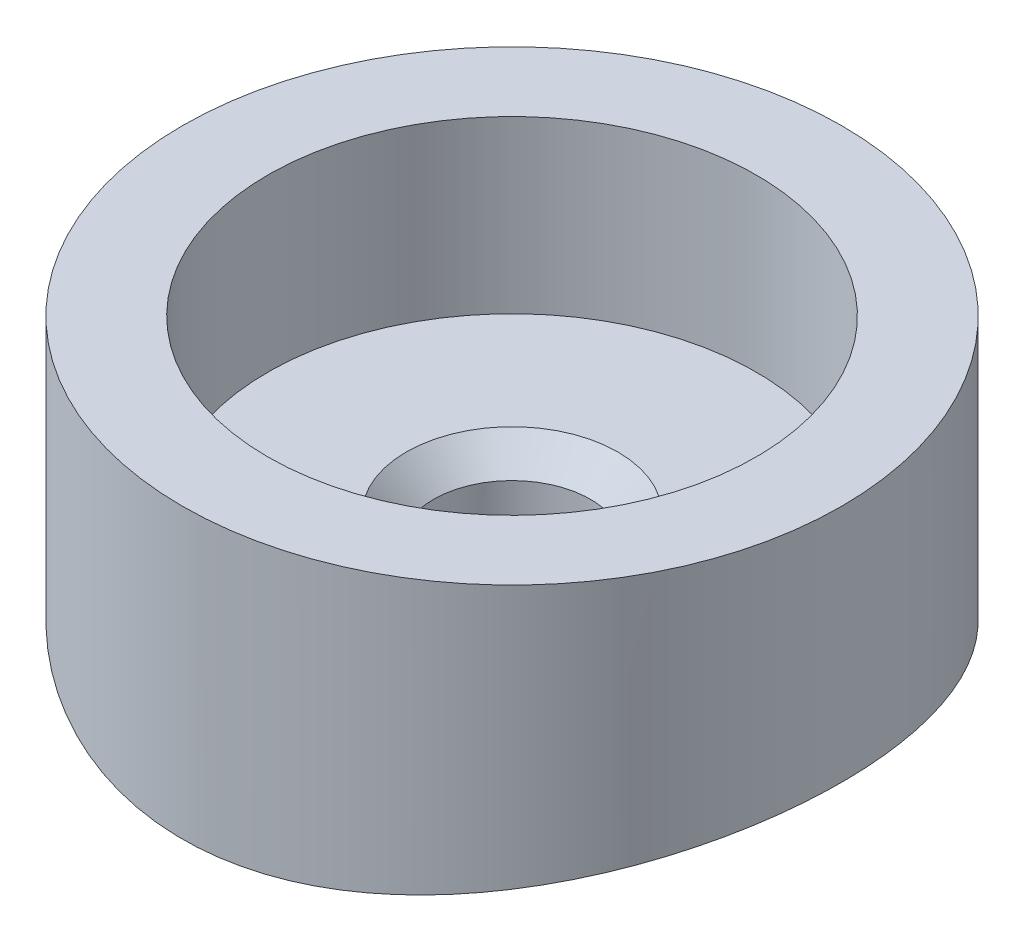
ISO-10303-21;
HEADER;
FILE_DESCRIPTION(('STEP AP214'),'2;1');
FILE_NAME('part.step','',(''),(''),'','','');
FILE_SCHEMA(('AUTOMOTIVE_DESIGN { 1 0 10303 214 1 1 1 1 }'));
ENDSEC;
DATA;
#1=APPLICATION_CONTEXT('core data for automotive mechanical design processes');
#2=APPLICATION_PROTOCOL_DEFINITION('international standard','automotive_design',2000,#1);
#3=PRODUCT_CONTEXT('',#1,'mechanical');
#4=PRODUCT('Part','Part','',(#3));
#5=PRODUCT_RELATED_PRODUCT_CATEGORY('part','',(#4));
#6=PRODUCT_DEFINITION_FORMATION('','',#4);
#7=PRODUCT_DEFINITION_CONTEXT('part definition',#1,'design');
#8=PRODUCT_DEFINITION('design','',#6,#7);
#9=PRODUCT_DEFINITION_SHAPE('','',#8);
#10=(LENGTH_UNIT() NAMED_UNIT(*) SI_UNIT(.MILLI.,.METRE.));
#11=(NAMED_UNIT(*) PLANE_ANGLE_UNIT() SI_UNIT($,.RADIAN.));
#12=(NAMED_UNIT(*) SI_UNIT($,.STERADIAN.) SOLID_ANGLE_UNIT());
#13=UNCERTAINTY_MEASURE_WITH_UNIT(LENGTH_MEASURE(1.E-05),#10,'distance_accuracy_value','');
#14=(GEOMETRIC_REPRESENTATION_CONTEXT(3) GLOBAL_UNCERTAINTY_ASSIGNED_CONTEXT((#13)) GLOBAL_UNIT_ASSIGNED_CONTEXT((#10,
#11,#12)) REPRESENTATION_CONTEXT('',''));
#15=CARTESIAN_POINT('',(0.,0.,0.));
#16=DIRECTION('',(0.,0.,1.));
#17=DIRECTION('',(1.,0.,0.));
#18=AXIS2_PLACEMENT_3D('',#15,#16,#17);
#19=CARTESIAN_POINT('',(0.,25.4,0.));
#20=DIRECTION('',(0.,-1.,0.));
#21=DIRECTION('',(0.,0.,-1.));
#22=AXIS2_PLACEMENT_3D('',#19,#20,#21);
#23=CYLINDRICAL_SURFACE('',#22,24.511);
#24=CARTESIAN_POINT('',(0.,25.4,0.));
#25=DIRECTION('',(0.,1.,0.));
#26=DIRECTION('',(0.,0.,1.));
#27=AXIS2_PLACEMENT_3D('',#24,#25,#26);
#28=CIRCLE('',#27,24.511);
#29=CARTESIAN_POINT('',(0.,25.4,24.511));
#30=VERTEX_POINT('',#29);
#31=EDGE_CURVE('E59',#30,#30,#28,.T.);
#32=ORIENTED_EDGE('',*,*,#31,.F.);
#33=EDGE_LOOP('',(#32));
#34=FACE_BOUND('',#33,.T.);
#35=CARTESIAN_POINT('',(0.,3.95611816324441,-24.511));
#36=CARTESIAN_POINT('',(0.672439461266802,3.95611933237046,-24.5109983821655));
#37=CARTESIAN_POINT('',(1.34490774312686,3.96460296071418,-24.4833048628042));
#38=CARTESIAN_POINT('',(2.68489418489964,3.99827435073769,-24.3727815587225));
#39=CARTESIAN_POINT('',(3.35241205692603,4.02346307630222,-24.2899485924528));
#40=CARTESIAN_POINT('',(4.67782904886675,4.0897696746324,-24.0698664591824));
#41=CARTESIAN_POINT('',(5.33572497877211,4.13089271127498,-23.9325996513156));
#42=CARTESIAN_POINT('',(6.63700138726666,4.22780625289299,-23.6048624955393));
#43=CARTESIAN_POINT('',(7.28038200028337,4.28359662197247,-23.4143926405665));
#44=CARTESIAN_POINT('',(8.54720598320212,4.40807186695242,-22.982201456061));
#45=CARTESIAN_POINT('',(9.17068020390343,4.47673553076574,-22.74056435422));
#46=CARTESIAN_POINT('',(10.3947216002538,4.62502317101238,-22.2077563735001));
#47=CARTESIAN_POINT('',(10.9952887445319,4.70464716245507,-21.9165854267881));
#48=CARTESIAN_POINT('',(12.1698047594676,4.87261875270195,-21.2868279448396));
#49=CARTESIAN_POINT('',(12.7437512406286,4.96096713239716,-20.9482371640749));
#50=CARTESIAN_POINT('',(13.8614939392133,5.14396259922234,-20.2259952261178));
#51=CARTESIAN_POINT('',(14.4052895291262,5.2386098173558,-19.8423431316115));
#52=CARTESIAN_POINT('',(15.4738539437055,5.43430678473352,-19.0214394472943));
#53=CARTESIAN_POINT('',(15.9977011891257,5.53546070349572,-18.5830126288436));
#54=CARTESIAN_POINT('',(17.0068779063594,5.73895805909062,-17.6641147432734));
#55=CARTESIAN_POINT('',(17.4922067419381,5.84130151553971,-17.1836429819446));
#56=CARTESIAN_POINT('',(18.4213068193913,6.04440563043572,-16.1836468043778));
#57=CARTESIAN_POINT('',(18.8650731619719,6.14516610112164,-15.664117797138));
#58=CARTESIAN_POINT('',(19.7080560703237,6.34236955506934,-14.589314821801));
#59=CARTESIAN_POINT('',(20.1072723400014,6.43881250963305,-14.0340406161688));
#60=CARTESIAN_POINT('',(20.865759050045,6.62659887375901,-12.880033049961));
#61=CARTESIAN_POINT('',(21.224092673961,6.71780520040733,-12.2806610030964));
#62=CARTESIAN_POINT('',(21.8888325615432,6.89043989110083,-11.0524091257498));
#63=CARTESIAN_POINT('',(22.1952379439457,6.97186808919654,-10.4235287947199));
#64=CARTESIAN_POINT('',(22.7535772935892,7.12260361408897,-9.14073691561948));
#65=CARTESIAN_POINT('',(23.0055198642564,7.19191285497195,-8.48682934031107));
#66=CARTESIAN_POINT('',(23.4528067176099,7.31641295531283,-7.15862927282911));
#67=CARTESIAN_POINT('',(23.6481528301848,7.37160427122766,-6.48433744050224));
#68=CARTESIAN_POINT('',(23.9759378753088,7.46495606344442,-5.13903701813658));
#69=CARTESIAN_POINT('',(24.1099466974427,7.50353984182799,-4.46844012838969));
#70=CARTESIAN_POINT('',(24.3215235147976,7.56472707140061,-3.11767726339343));
#71=CARTESIAN_POINT('',(24.3990924409542,7.58733078616917,-2.43751144616529));
#72=CARTESIAN_POINT('',(24.4970616622139,7.61591202887948,-1.0728443667576));
#73=CARTESIAN_POINT('',(24.5174718466021,7.62189243289188,-0.388343875081363));
#74=CARTESIAN_POINT('',(24.5009588292408,7.61706384494563,0.97989951770401));
#75=CARTESIAN_POINT('',(24.4640366230984,7.60625514453861,1.66364243176254));
#76=CARTESIAN_POINT('',(24.3351966204611,7.56873784232517,3.00452063765059));
#77=CARTESIAN_POINT('',(24.2449803902096,7.54252130748482,3.66183406526121));
#78=CARTESIAN_POINT('',(24.0117582916153,7.47529717133117,4.96623963600978));
#79=CARTESIAN_POINT('',(23.8687536767442,7.43428992122719,5.61333202146821));
#80=CARTESIAN_POINT('',(23.5311505226389,7.33856682979501,6.89288906655393));
#81=CARTESIAN_POINT('',(23.3365501046254,7.28385048927607,7.52535319260442));
#82=CARTESIAN_POINT('',(22.8973216369488,7.1621384113216,8.77144366397134));
#83=CARTESIAN_POINT('',(22.65269267351,7.09514244960007,9.38506966497234));
#84=CARTESIAN_POINT('',(22.1122506418935,6.94978315093326,10.5963314149898));
#85=CARTESIAN_POINT('',(21.8158928158568,6.87130043231037,11.193709678465));
#86=CARTESIAN_POINT('',(21.1761105050005,6.70558189032595,12.3614200061621));
#87=CARTESIAN_POINT('',(20.8326858476623,6.61834603488102,12.9317519712383));
#88=CARTESIAN_POINT('',(20.1010796281978,6.43734674182274,14.0420006040339));
#89=CARTESIAN_POINT('',(19.7128896311069,6.34358207533312,14.5819115110041));
#90=CARTESIAN_POINT('',(18.8943436377233,6.15193507621414,15.6279879149711));
#91=CARTESIAN_POINT('',(18.4639865884531,6.05405264079246,16.1341525687402));
#92=CARTESIAN_POINT('',(17.5472480792388,5.85304362068182,17.127658181312));
#93=CARTESIAN_POINT('',(17.0593894214007,5.74985647191987,17.6136248529923));
#94=CARTESIAN_POINT('',(16.0443941823616,5.5445954954274,18.5429235873149));
#95=CARTESIAN_POINT('',(15.5172566186459,5.44252169561921,18.9862545828413));
#96=CARTESIAN_POINT('',(14.4270128590964,5.24234084760505,19.8273668591961));
#97=CARTESIAN_POINT('',(13.8639031978519,5.14423418306848,20.2251437411803));
#98=CARTESIAN_POINT('',(12.7053612529077,4.95480867398079,20.9723157744948));
#99=CARTESIAN_POINT('',(12.1099291039313,4.86348980114124,21.3217111274625));
#100=CARTESIAN_POINT('',(10.8852699597663,4.68956595793405,21.9723686081417));
#101=CARTESIAN_POINT('',(10.2557925874669,4.60704434055054,22.2731822159802));
#102=CARTESIAN_POINT('',(8.97220264506266,4.45418604208721,22.8205056276365));
#103=CARTESIAN_POINT('',(8.31808982757532,4.38384948340617,23.0670148859744));
#104=CARTESIAN_POINT('',(6.99008791386871,4.25761543075024,23.5035356612869));
#105=CARTESIAN_POINT('',(6.31620384604644,4.20171430027948,23.6935614091109));
#106=CARTESIAN_POINT('',(4.95355662501248,4.10615923770417,24.015441755164));
#107=CARTESIAN_POINT('',(4.26479403542995,4.0665046912777,24.1472985529136));
#108=CARTESIAN_POINT('',(2.90241112597617,4.00586471317743,24.3479411452842));
#109=CARTESIAN_POINT('',(2.22912328044284,3.98426555908904,24.4188029843395));
#110=CARTESIAN_POINT('',(0.878667984200728,3.95809154771318,24.5045873055504));
#111=CARTESIAN_POINT('',(0.201500625517226,3.95351628826567,24.5195111091453));
#112=CARTESIAN_POINT('',(-1.15155968494945,3.96153518294057,24.4932818309327));
#113=CARTESIAN_POINT('',(-1.82745277951528,3.97412728289639,24.4521354582226));
#114=CARTESIAN_POINT('',(-3.17299891098591,4.01607701008528,24.314164041443));
#115=CARTESIAN_POINT('',(-3.84265199524163,4.04543450999238,24.2173394202255));
#116=CARTESIAN_POINT('',(-5.15461133188995,4.11908089593361,23.9719333052184));
#117=CARTESIAN_POINT('',(-5.79718635003406,4.1629885564718,23.8246703275078));
#118=CARTESIAN_POINT('',(-7.06736315571993,4.26458914710448,23.4792391305248));
#119=CARTESIAN_POINT('',(-7.69496524771666,4.32228179663595,23.2810719472889));
#120=CARTESIAN_POINT('',(-8.93119025698214,4.44980686281607,22.8353832193617));
#121=CARTESIAN_POINT('',(-9.53981106782957,4.51964062119367,22.587856219411));
#122=CARTESIAN_POINT('',(-10.7341866849039,4.66949298895082,22.0453320951926));
#123=CARTESIAN_POINT('',(-11.3199408827549,4.74951186906886,21.7503337089966));
#124=CARTESIAN_POINT('',(-12.4798658216712,4.91974402512747,21.1067072697969));
#125=CARTESIAN_POINT('',(-13.0533512738377,5.01016654878256,20.7568951236687));
#126=CARTESIAN_POINT('',(-13.8899552417421,5.15022080939856,20.1982871531259));
#127=CARTESIAN_POINT('',(-14.1648995850313,5.19764489727727,20.0064253148044));
#128=CARTESIAN_POINT('',(-14.7066256039953,5.29366267543229,19.6116452750283));
#129=CARTESIAN_POINT('',(-14.973405358047,5.34225663631498,19.4087245015145));
#130=CARTESIAN_POINT('',(-15.7607972754871,5.48929034963258,18.7839108831268));
#131=CARTESIAN_POINT('',(-16.2685323048607,5.588993815259,18.3459198382605));
#132=CARTESIAN_POINT('',(-17.2463552599799,5.7890902024626,17.4298931576228));
#133=CARTESIAN_POINT('',(-17.7164425888244,5.88948313494383,16.9518568871835));
#134=CARTESIAN_POINT('',(-18.3991420240076,6.04037988008894,16.1981838036953));
#135=CARTESIAN_POINT('',(-18.6266450911464,6.09160667398979,15.9360491271689));
#136=CARTESIAN_POINT('',(-19.0703419025587,6.19317083868109,15.4023244042882));
#137=CARTESIAN_POINT('',(-19.2865383455482,6.24350841979577,15.1307366402538));
#138=CARTESIAN_POINT('',(-19.9177241966497,6.39268596350902,14.3022821778855));
#139=CARTESIAN_POINT('',(-20.3153455418735,6.48969863609815,13.7316852115602));
#140=CARTESIAN_POINT('',(-21.0611132465547,6.6760721564818,12.5579542331628));
#141=CARTESIAN_POINT('',(-21.4092608280715,6.76543319325892,11.9548210252814));
#142=CARTESIAN_POINT('',(-22.0534860808713,6.93400535146808,10.7199692743643));
#143=CARTESIAN_POINT('',(-22.3495647196834,7.01321666149179,10.088251262757));
#144=CARTESIAN_POINT('',(-22.8851498571596,7.15866726717481,8.80558661166567));
#145=CARTESIAN_POINT('',(-23.1250734467758,7.22500153398569,8.15482495297129));
#146=CARTESIAN_POINT('',(-23.5492021428498,7.34356172813698,6.83412037963354));
#147=CARTESIAN_POINT('',(-23.7334073096375,7.39578767075333,6.16417748575973));
#148=CARTESIAN_POINT('',(-24.0444005532548,7.4846117803785,4.81022727537972));
#149=CARTESIAN_POINT('',(-24.1712015318446,7.52121345888098,4.12622315534019));
#150=CARTESIAN_POINT('',(-24.3662529047389,7.57773459508749,2.74924052496387));
#151=CARTESIAN_POINT('',(-24.4345051427669,7.5976545781044,2.05626229792299));
#152=CARTESIAN_POINT('',(-24.5103903409365,7.6198143952852,0.692253526761296));
#153=CARTESIAN_POINT('',(-24.5201560374291,7.62267624254456,0.0213508354193745));
#154=CARTESIAN_POINT('',(-24.4846697542139,7.61230240710891,-1.31886119452387));
#155=CARTESIAN_POINT('',(-24.4394192095864,7.59906714430163,-1.9881705742299));
#156=CARTESIAN_POINT('',(-24.2943130902382,7.556863159362,-3.32029626021981));
#157=CARTESIAN_POINT('',(-24.1944605476255,7.52789531087774,-3.98311292497092));
#158=CARTESIAN_POINT('',(-23.9410327155925,7.4550154885644,-5.29755366244506));
#159=CARTESIAN_POINT('',(-23.7874572049479,7.41110345319713,-5.94917768906667));
#160=CARTESIAN_POINT('',(-23.4296577868154,7.31001747577756,-7.23037383182745));
#161=CARTESIAN_POINT('',(-23.2259449411249,7.25297770669914,-7.86009946747376));
#162=CARTESIAN_POINT('',(-22.7687598817067,7.12689514293365,-9.09995985613834));
#163=CARTESIAN_POINT('',(-22.515288202381,7.0578524771567,-9.71009481947541));
#164=CARTESIAN_POINT('',(-21.9604681863937,6.90953021140978,-10.9069752358529));
#165=CARTESIAN_POINT('',(-21.659114128609,6.83024938836785,-11.49371788342));
#166=CARTESIAN_POINT('',(-21.0106965449954,6.66346917542777,-12.6401533576455));
#167=CARTESIAN_POINT('',(-20.6636318332027,6.57596957231012,-13.1998454819624));
#168=CARTESIAN_POINT('',(-19.914755933992,6.39216082286002,-14.3056328813799));
#169=CARTESIAN_POINT('',(-19.5115874789549,6.29566331587727,-14.8507779723375));
#170=CARTESIAN_POINT('',(-18.6618784833228,6.09883483129013,-15.9054080790554));
#171=CARTESIAN_POINT('',(-18.2153370925902,5.99850377856915,-16.4148923955042));
#172=CARTESIAN_POINT('',(-17.2816388219407,5.79664966721668,-17.3951828034199));
#173=CARTESIAN_POINT('',(-16.7944712800706,5.69512630171804,-17.8659786766959));
#174=CARTESIAN_POINT('',(-15.7826663652626,5.49363557746831,-18.7657915076295));
#175=CARTESIAN_POINT('',(-15.2580286562414,5.39366823268352,-19.1948080904721));
#176=CARTESIAN_POINT('',(-14.1593632933614,5.19527571184565,-20.0196521444934));
#177=CARTESIAN_POINT('',(-13.5843653046905,5.09697163971242,-20.414217588427));
#178=CARTESIAN_POINT('',(-12.4019265884408,4.90777115545648,-21.1534274933535));
#179=CARTESIAN_POINT('',(-11.7944845027577,4.81687505383307,-21.49806986233));
#180=CARTESIAN_POINT('',(-10.5515334176141,4.64528121738254,-22.1346239257128));
#181=CARTESIAN_POINT('',(-9.91603726564838,4.56457887833263,-22.4265594520156));
#182=CARTESIAN_POINT('',(-8.62117119590666,4.4158450073686,-22.9554676785231));
#183=CARTESIAN_POINT('',(-7.96180386040208,4.34781210979714,-23.1924463032876));
#184=CARTESIAN_POINT('',(-6.70510833538356,4.23394136369459,-23.5841007948829));
#185=CARTESIAN_POINT('',(-6.10994814993972,4.18641275807165,-23.7452710314507));
#186=CARTESIAN_POINT('',(-4.90836870468701,4.10402386555208,-24.0224291194323));
#187=CARTESIAN_POINT('',(-4.30195052641124,4.06916236830333,-24.1384212877222));
#188=CARTESIAN_POINT('',(-3.08155968180374,4.01301526827835,-24.324350620354));
#189=CARTESIAN_POINT('',(-2.46758814949318,3.99172765234332,-24.3942946142064));
#190=CARTESIAN_POINT('',(-1.23575271378694,3.96327803675986,-24.4876217808779));
#191=CARTESIAN_POINT('',(-0.61788852398558,3.95611708896248,-24.5110014865894));
#192=CARTESIAN_POINT('',(0.,3.95611816324441,-24.511));
#193=B_SPLINE_CURVE_WITH_KNOTS('',3,(#35,#36,#37,#38,#39,#40,#41,#42,#43,#44,#45,#46,#47,#48,
#49,#50,#51,#52,#53,#54,#55,#56,#57,#58,#59,#60,#61,#62,#63,#64,#65,#66,#67,#68,#69,#70,#71,#72,
#73,#74,#75,#76,#77,#78,#79,#80,#81,#82,#83,#84,#85,#86,#87,#88,#89,#90,#91,#92,#93,#94,#95,#96,
#97,#98,#99,#100,#101,#102,#103,#104,#105,#106,#107,#108,#109,#110,#111,#112,#113,#114,#115,
#116,#117,#118,#119,#120,#121,#122,#123,#124,#125,#126,#127,#128,#129,#130,#131,#132,#133,#134,
#135,#136,#137,#138,#139,#140,#141,#142,#143,#144,#145,#146,#147,#148,#149,#150,#151,#152,#153,
#154,#155,#156,#157,#158,#159,#160,#161,#162,#163,#164,#165,#166,#167,#168,#169,#170,#171,#172,
#173,#174,#175,#176,#177,#178,#179,#180,#181,#182,#183,#184,#185,#186,#187,#188,#189,#190,#191,
#192),.UNSPECIFIED.,.T.,.F.,(4,2,2,2,2,2,2,2,2,2,2,2,2,2,2,2,2,2,2,2,2,2,2,2,2,2,2,2,2,2,2,2,2,
2,2,2,2,2,2,2,2,2,2,2,2,2,2,2,2,2,2,2,2,2,2,2,2,2,2,2,2,2,2,2,2,2,2,2,2,2,2,2,2,2,2,2,2,2,4),
(0.,2.01674754602501,4.03361146858648,6.05112954929806,8.06862893793559,10.0828327345998,
12.0970392895961,14.1114262932231,16.1258552052542,18.1951482279544,20.2644754234592,
22.3340462404375,24.4036308115998,26.5137984206498,28.6240018373444,30.7338716637037,
32.8436732656968,34.8959534785088,36.9481998396642,39.0000911107224,41.051946750007,
43.041584488148,45.0311749849409,47.0208379394627,49.0105372385931,51.022616191739,
53.0347025201493,55.047168599821,57.0596849467452,59.1461220850841,61.2326114306684,
63.3193020844477,65.4059840413585,67.5109476805732,69.6159324628997,71.7203864502728,
73.8247608558994,75.8543047158086,77.8838006309535,79.9130537273435,81.9422914126395,
83.9220874536528,85.901843203719,87.8818178782721,89.8618451950386,91.8927928908927,
92.9083726705587,93.9241896676654,95.9555686336607,97.9869798006208,99.0392556863201,
100.091279252917,102.19516687141,104.299002512401,106.402799056436,108.490435193965,
110.578069071075,112.665233513105,114.752332227069,116.762836778596,118.77328888791,
120.78362936598,122.793978122468,124.784627030343,126.775254560137,128.766120114884,
130.757037332852,132.809293636087,134.861590173002,136.914427021269,138.967282284475,
141.077487658756,143.18778143521,145.297118619554,147.406228303631,149.259683451294,
151.112961453267,152.965964529364,154.819105572153),.UNSPECIFIED.);
#194=CARTESIAN_POINT('',(0.,3.95611816324441,-24.511));
#195=VERTEX_POINT('',#194);
#196=EDGE_CURVE('E76',#195,#195,#193,.T.);
#197=ORIENTED_EDGE('',*,*,#196,.F.);
#198=EDGE_LOOP('',(#197));
#199=FACE_BOUND('',#198,.T.);
#200=ADVANCED_FACE('F45',(#34,#199),#23,.T.);
#201=CARTESIAN_POINT('',(0.,25.4,0.));
#202=DIRECTION('',(0.,1.,0.));
#203=DIRECTION('',(0.,0.,1.));
#204=AXIS2_PLACEMENT_3D('',#201,#202,#203);
#205=PLANE('',#204);
#206=CARTESIAN_POINT('',(0.,25.4,0.));
#207=DIRECTION('',(0.,1.,0.));
#208=DIRECTION('',(0.,0.,1.));
#209=AXIS2_PLACEMENT_3D('',#206,#207,#208);
#210=CIRCLE('',#209,18.161);
#211=CARTESIAN_POINT('',(0.,25.4,18.161));
#212=VERTEX_POINT('',#211);
#213=EDGE_CURVE('E116',#212,#212,#210,.T.);
#214=ORIENTED_EDGE('',*,*,#213,.F.);
#215=EDGE_LOOP('',(#214));
#216=FACE_BOUND('',#215,.T.);
#217=ORIENTED_EDGE('',*,*,#31,.T.);
#218=EDGE_LOOP('',(#217));
#219=FACE_BOUND('',#218,.T.);
#220=ADVANCED_FACE('F96',(#216,#219),#205,.T.);
#221=CARTESIAN_POINT('',(0.,12.7,0.));
#222=DIRECTION('',(0.,1.,0.));
#223=DIRECTION('',(0.,0.,1.));
#224=AXIS2_PLACEMENT_3D('',#221,#222,#223);
#225=CYLINDRICAL_SURFACE('',#224,18.161);
#226=CARTESIAN_POINT('',(0.,12.7,0.));
#227=DIRECTION('',(0.,1.,0.));
#228=DIRECTION('',(0.,0.,1.));
#229=AXIS2_PLACEMENT_3D('',#226,#227,#228);
#230=CIRCLE('',#229,18.161);
#231=CARTESIAN_POINT('',(0.,12.7,18.161));
#232=VERTEX_POINT('',#231);
#233=EDGE_CURVE('E64',#232,#232,#230,.T.);
#234=ORIENTED_EDGE('',*,*,#233,.F.);
#235=EDGE_LOOP('',(#234));
#236=FACE_BOUND('',#235,.T.);
#237=ORIENTED_EDGE('',*,*,#213,.T.);
#238=EDGE_LOOP('',(#237));
#239=FACE_BOUND('',#238,.T.);
#240=ADVANCED_FACE('F102',(#236,#239),#225,.F.);
#241=CARTESIAN_POINT('',(0.,12.7,0.));
#242=DIRECTION('',(0.,1.,0.));
#243=DIRECTION('',(0.,0.,1.));
#244=AXIS2_PLACEMENT_3D('',#241,#242,#243);
#245=PLANE('',#244);
#246=CARTESIAN_POINT('',(0.,12.7,0.));
#247=DIRECTION('',(0.,1.,0.));
#248=DIRECTION('',(0.,0.,1.));
#249=AXIS2_PLACEMENT_3D('',#246,#247,#248);
#250=CIRCLE('',#249,7.87399999999998);
#251=CARTESIAN_POINT('',(0.,12.7,7.87399999999998));
#252=VERTEX_POINT('',#251);
#253=EDGE_CURVE('E10',#252,#252,#250,.F.);
#254=ORIENTED_EDGE('',*,*,#253,.T.);
#255=EDGE_LOOP('',(#254));
#256=FACE_BOUND('',#255,.T.);
#257=ORIENTED_EDGE('',*,*,#233,.T.);
#258=EDGE_LOOP('',(#257));
#259=FACE_BOUND('',#258,.T.);
#260=ADVANCED_FACE('F92',(#256,#259),#245,.T.);
#261=CARTESIAN_POINT('',(41.402,-76.2,0.));
#262=DIRECTION('',(-1.,0.,0.));
#263=DIRECTION('',(0.,0.,1.));
#264=AXIS2_PLACEMENT_3D('',#261,#262,#263);
#265=CYLINDRICAL_SURFACE('',#264,83.82);
#266=CARTESIAN_POINT('',(0.,7.41616731230869,5.842));
#267=CARTESIAN_POINT('',(-0.163918437895121,7.41616704503577,5.84200138134615));
#268=CARTESIAN_POINT('',(-0.327815005290295,7.41665032630765,5.83509828816169));
#269=CARTESIAN_POINT('',(-0.654494898545929,7.41856927995619,5.80753557410054));
#270=CARTESIAN_POINT('',(-0.817277933641029,7.42000519216173,5.78687248908273));
#271=CARTESIAN_POINT('',(-1.14065334195021,7.42379062355907,5.73191048240755));
#272=CARTESIAN_POINT('',(-1.30124374417022,7.4261409150735,5.69760003307112));
#273=CARTESIAN_POINT('',(-1.61901287286503,7.43168892469467,5.61557623593232));
#274=CARTESIAN_POINT('',(-1.77619032904551,7.43488695267082,5.56785798685218));
#275=CARTESIAN_POINT('',(-2.08581403985104,7.44203560908434,5.45941630356424));
#276=CARTESIAN_POINT('',(-2.2382644685672,7.44598555020212,5.39870474022206));
#277=CARTESIAN_POINT('',(-2.53756047840752,7.45452923657861,5.26466021083492));
#278=CARTESIAN_POINT('',(-2.68440397188112,7.45912321871795,5.19132259860977));
#279=CARTESIAN_POINT('',(-2.97130348970712,7.4688205650488,5.0326115325507));
#280=CARTESIAN_POINT('',(-3.11136350347485,7.47392362430914,4.94724527124455));
#281=CARTESIAN_POINT('',(-3.38385333313485,7.48449888782972,4.76501575537067));
#282=CARTESIAN_POINT('',(-3.51628030855829,7.48997122788624,4.66814826137945));
#283=CARTESIAN_POINT('',(-3.7726762167575,7.50113555856265,4.46349829410777));
#284=CARTESIAN_POINT('',(-3.89663432503641,7.50682781625016,4.35570227378886));
#285=CARTESIAN_POINT('',(-4.13507884868986,7.51826636171908,4.13001746579126));
#286=CARTESIAN_POINT('',(-4.24956174788621,7.52401266868464,4.01212496411404));
#287=CARTESIAN_POINT('',(-4.46815950573803,7.53539258511553,3.76715470350704));
#288=CARTESIAN_POINT('',(-4.57227773508639,7.54102623074002,3.64007995409036));
#289=CARTESIAN_POINT('',(-4.76948781193921,7.55202534911743,3.3775601384465));
#290=CARTESIAN_POINT('',(-4.86257557540571,7.55739072211986,3.24211200003557));
#291=CARTESIAN_POINT('',(-5.03707428079636,7.56770235729537,2.96375528291119));
#292=CARTESIAN_POINT('',(-5.11847774373895,7.57264835020675,2.82084200495859));
#293=CARTESIAN_POINT('',(-5.26898374026431,7.58197886158148,2.52859721102992));
#294=CARTESIAN_POINT('',(-5.33808171408466,7.5863631717468,2.37926334126248));
#295=CARTESIAN_POINT('',(-5.46342070305973,7.594441810503,2.07532996762533));
#296=CARTESIAN_POINT('',(-5.51966658986714,7.59813640043855,1.92073248457418));
#297=CARTESIAN_POINT('',(-5.61894687792819,7.60473485782323,1.60731882601732));
#298=CARTESIAN_POINT('',(-5.66197640381072,7.60763843343128,1.4485011171331));
#299=CARTESIAN_POINT('',(-5.77055151259466,7.61501765718389,0.968046364317759));
#300=CARTESIAN_POINT('',(-5.81592741589028,7.61818471442322,0.641571678247728));
#301=CARTESIAN_POINT('',(-5.85121693548596,7.6206413412225,-0.0141972447138992));
#302=CARTESIAN_POINT('',(-5.84113130435213,7.61993096339595,-0.343491443286561));
#303=CARTESIAN_POINT('',(-5.76592914686924,7.6147241538053,-0.995166181834247));
#304=CARTESIAN_POINT('',(-5.7009082326103,7.61023430007829,-1.31755773656404));
#305=CARTESIAN_POINT('',(-5.51781043798664,7.59797967711258,-1.94682695130287));
#306=CARTESIAN_POINT('',(-5.39973318326727,7.59021488476662,-2.25370450183128));
#307=CARTESIAN_POINT('',(-5.11377187282569,7.57227355677162,-2.84355628259415));
#308=CARTESIAN_POINT('',(-4.94584463600307,7.5620949317539,-3.12650951493553));
#309=CARTESIAN_POINT('',(-4.56498020751992,7.54047081951533,-3.66024720650287));
#310=CARTESIAN_POINT('',(-4.35204238189709,7.52902531445188,-3.91103121255378));
#311=CARTESIAN_POINT('',(-3.8866618722659,7.50612628787994,-4.37387124232473));
#312=CARTESIAN_POINT('',(-3.63413614879023,7.49467280107611,-4.58584378179903));
#313=CARTESIAN_POINT('',(-3.09703846410046,7.47307336219712,-4.96439937378487));
#314=CARTESIAN_POINT('',(-2.81246648652135,7.46292741078969,-5.13098240311725));
#315=CARTESIAN_POINT('',(-2.21929946402166,7.44508917119116,-5.41402529812407));
#316=CARTESIAN_POINT('',(-1.91070261343599,7.43739706764865,-5.53048139204769));
#317=CARTESIAN_POINT('',(-1.27827122976377,7.42534025999046,-5.7099056932574));
#318=CARTESIAN_POINT('',(-0.954436919978839,7.4209755071293,-5.77287468412775));
#319=CARTESIAN_POINT('',(-0.301452028000944,7.41607481507384,-5.84343279387724));
#320=CARTESIAN_POINT('',(0.0276859443642882,7.41553084460627,-5.85113807762569));
#321=CARTESIAN_POINT('',(0.68257580661136,7.41831206984687,-5.81125379733356));
#322=CARTESIAN_POINT('',(1.00832771845784,7.42163724044093,-5.76366459220247));
#323=CARTESIAN_POINT('',(1.64686850849791,7.43177471587446,-5.61463884451295));
#324=CARTESIAN_POINT('',(1.95966998467947,7.43858354140439,-5.51325602473192));
#325=CARTESIAN_POINT('',(2.56381989829188,7.45491814009324,-5.25957532448734));
#326=CARTESIAN_POINT('',(2.85516809389359,7.46444394387302,-5.10727687019154));
#327=CARTESIAN_POINT('',(3.40867414455948,7.48515857428482,-4.75579246508246));
#328=CARTESIAN_POINT('',(3.67078255269606,7.49635014546115,-4.55652881139188));
#329=CARTESIAN_POINT('',(4.15786998644097,7.51912567639398,-4.11688201834864));
#330=CARTESIAN_POINT('',(4.38284856257592,7.53070964089855,-3.87649838129176));
#331=CARTESIAN_POINT('',(4.78968415715648,7.55298837161304,-3.36093899993156));
#332=CARTESIAN_POINT('',(4.97146590969921,7.5636815650039,-3.08570379070696));
#333=CARTESIAN_POINT('',(5.28623055711265,7.58295099096076,-2.50853603210692));
#334=CARTESIAN_POINT('',(5.41921381212622,7.5915272391501,-2.20660367978227));
#335=CARTESIAN_POINT('',(5.63248256554152,7.60559008961779,-1.58494786821205));
#336=CARTESIAN_POINT('',(5.71281535161137,7.61107946372046,-1.26524065413539));
#337=CARTESIAN_POINT('',(5.81863360205451,7.6183572679558,-0.616657598470678));
#338=CARTESIAN_POINT('',(5.84411976197512,7.62014574502205,-0.287781873208319));
#339=CARTESIAN_POINT('',(5.84073007284052,7.61991248704004,0.204562826185495));
#340=CARTESIAN_POINT('',(5.83267878143977,7.6193497955241,0.368430671415432));
#341=CARTESIAN_POINT('',(5.80283622306232,7.61727792482993,0.694888008621803));
#342=CARTESIAN_POINT('',(5.78105004124393,7.61576909594744,0.857477951177749));
#343=CARTESIAN_POINT('',(5.72387789890201,7.6118453084887,1.18028776318112));
#344=CARTESIAN_POINT('',(5.68848692249636,7.6094300157207,1.34050673583597));
#345=CARTESIAN_POINT('',(5.60437878607445,7.60376325948876,1.65733250189475));
#346=CARTESIAN_POINT('',(5.55566652439894,7.60051210340455,1.81394060013845));
#347=CARTESIAN_POINT('',(5.44523942223927,7.59326366302645,2.12254569571763));
#348=CARTESIAN_POINT('',(5.38352010285678,7.58926612177375,2.27454108401727));
#349=CARTESIAN_POINT('',(5.2475552170985,7.58064020527674,2.57273583661639));
#350=CARTESIAN_POINT('',(5.17331425543872,7.57601206205015,2.71893730725468));
#351=CARTESIAN_POINT('',(5.01279073445852,7.56625269201527,3.00462112592408));
#352=CARTESIAN_POINT('',(4.92650406688031,7.5611212937473,3.14410115964577));
#353=CARTESIAN_POINT('',(4.74255398698861,7.55050346001815,3.41525645786744));
#354=CARTESIAN_POINT('',(4.64489474931066,7.54501715516251,3.54693455968228));
#355=CARTESIAN_POINT('',(4.4386192842257,7.5338291841783,3.80191766039918));
#356=CARTESIAN_POINT('',(4.32997763884948,7.52812703848758,3.9252020767572));
#357=CARTESIAN_POINT('',(4.10274167316331,7.5166832692438,4.16213994694515));
#358=CARTESIAN_POINT('',(3.9841510202598,7.51094166094774,4.27579691886823));
#359=CARTESIAN_POINT('',(3.7377443042697,7.49957596387848,4.49279410859755));
#360=CARTESIAN_POINT('',(3.60992262995482,7.4939519493107,4.59612795881709));
#361=CARTESIAN_POINT('',(3.34607051432733,7.48298667910483,4.79163084615041));
#362=CARTESIAN_POINT('',(3.21004311900978,7.47764531990939,4.88380398841686));
#363=CARTESIAN_POINT('',(2.93044476307375,7.46738548585382,5.05653125021161));
#364=CARTESIAN_POINT('',(2.78686060612756,7.46246779316776,5.13706405748811));
#365=CARTESIAN_POINT('',(2.49344964230349,7.45320816195049,5.28570811133576));
#366=CARTESIAN_POINT('',(2.34362514182782,7.44886601313945,5.3538238980033));
#367=CARTESIAN_POINT('',(2.0388763569836,7.4408828161208,5.47712881345748));
#368=CARTESIAN_POINT('',(1.88395655894945,7.43724116951044,5.53232898418709));
#369=CARTESIAN_POINT('',(1.57005200013031,7.43075911486236,5.62946660934196));
#370=CARTESIAN_POINT('',(1.41106828492701,7.42791850294958,5.67140743879321));
#371=CARTESIAN_POINT('',(1.04542398295632,7.42245109008725,5.75153361642027));
#372=CARTESIAN_POINT('',(0.837804671622554,7.42010363871295,5.78542790455287));
#373=CARTESIAN_POINT('',(0.420111601092527,7.41696192243911,5.83066019130969));
#374=CARTESIAN_POINT('',(0.210037846257138,7.41616765478042,5.84199823000406));
#375=CARTESIAN_POINT('',(0.,7.41616731230869,5.842));
#376=B_SPLINE_CURVE_WITH_KNOTS('',3,(#266,#267,#268,#269,#270,#271,#272,#273,#274,#275,#276,
#277,#278,#279,#280,#281,#282,#283,#284,#285,#286,#287,#288,#289,#290,#291,#292,#293,#294,#295,
#296,#297,#298,#299,#300,#301,#302,#303,#304,#305,#306,#307,#308,#309,#310,#311,#312,#313,#314,
#315,#316,#317,#318,#319,#320,#321,#322,#323,#324,#325,#326,#327,#328,#329,#330,#331,#332,#333,
#334,#335,#336,#337,#338,#339,#340,#341,#342,#343,#344,#345,#346,#347,#348,#349,#350,#351,#352,
#353,#354,#355,#356,#357,#358,#359,#360,#361,#362,#363,#364,#365,#366,#367,#368,#369,#370,#371,
#372,#373,#374,#375),.UNSPECIFIED.,.T.,.F.,(4,2,2,2,2,2,2,2,2,2,2,2,2,2,2,2,2,2,2,2,2,2,2,2,2,2,
2,2,2,2,2,2,2,2,2,2,2,2,2,2,2,2,2,2,2,2,2,2,2,2,2,2,2,2,4),(0.,0.491571747608141,
0.983267297470181,1.47537905856757,1.96767094776338,2.45951497799705,2.95154038718672,
3.4432728286439,3.93518709165869,4.42771876737259,4.92043240591609,5.41298528203009,
5.90571996011521,6.39876863860582,6.89199963639243,7.38504336101439,7.87826874624174,
8.86204115023496,9.84580020530192,10.8278505960341,11.8099079160212,12.7928184093542,
13.7757427476457,14.7607571546356,15.7457720646439,16.7308610781572,17.7159356599009,
18.6989389964519,19.6819359524892,20.6639530486629,21.645981212794,22.6296456691998,
23.6133220324346,24.5986999825629,25.5840706602545,26.568555116621,27.5530270879979,
28.044748261428,28.5362874885398,29.0280081128125,29.519548170122,30.0112577635208,
30.502786928034,30.9944841428433,31.486001431357,31.9786835430455,32.4711848334296,
32.9639880604371,33.456609469423,33.9501216927724,34.4434531072954,34.9363612043791,
35.4291437356811,36.059023179942,36.6889015052499),.UNSPECIFIED.);
#377=CARTESIAN_POINT('',(0.,7.41616731230869,5.842));
#378=VERTEX_POINT('',#377);
#379=EDGE_CURVE('E67',#378,#378,#376,.T.);
#380=ORIENTED_EDGE('',*,*,#379,.F.);
#381=EDGE_LOOP('',(#380));
#382=FACE_BOUND('',#381,.T.);
#383=ORIENTED_EDGE('',*,*,#196,.T.);
#384=EDGE_LOOP('',(#383));
#385=FACE_BOUND('',#384,.T.);
#386=ADVANCED_FACE('F80',(#382,#385),#265,.F.);
#387=CARTESIAN_POINT('',(0.,-30.226,0.));
#388=DIRECTION('',(0.,1.,0.));
#389=DIRECTION('',(0.,0.,1.));
#390=AXIS2_PLACEMENT_3D('',#387,#388,#389);
#391=CYLINDRICAL_SURFACE('',#390,5.842);
#392=CARTESIAN_POINT('',(0.,10.668,0.));
#393=DIRECTION('',(0.,1.,0.));
#394=DIRECTION('',(0.,0.,1.));
#395=AXIS2_PLACEMENT_3D('',#392,#393,#394);
#396=CIRCLE('',#395,5.842);
#397=CARTESIAN_POINT('',(0.,10.668,5.842));
#398=VERTEX_POINT('',#397);
#399=EDGE_CURVE('E54',#398,#398,#396,.T.);
#400=ORIENTED_EDGE('',*,*,#399,.T.);
#401=EDGE_LOOP('',(#400));
#402=FACE_BOUND('',#401,.T.);
#403=ORIENTED_EDGE('',*,*,#379,.T.);
#404=EDGE_LOOP('',(#403));
#405=FACE_BOUND('',#404,.T.);
#406=ADVANCED_FACE('F83',(#402,#405),#391,.F.);
#407=CARTESIAN_POINT('',(0.,10.668,0.));
#408=DIRECTION('',(0.,1.,0.));
#409=DIRECTION('',(0.,0.,1.));
#410=AXIS2_PLACEMENT_3D('',#407,#408,#409);
#411=CONICAL_SURFACE('',#410,5.842,0.78539816339745);
#412=ORIENTED_EDGE('',*,*,#253,.F.);
#413=EDGE_LOOP('',(#412));
#414=FACE_BOUND('',#413,.T.);
#415=ORIENTED_EDGE('',*,*,#399,.F.);
#416=EDGE_LOOP('',(#415));
#417=FACE_BOUND('',#416,.T.);
#418=ADVANCED_FACE('F48',(#414,#417),#411,.F.);
#419=CLOSED_SHELL('',(#200,#220,#240,#260,#386,#406,#418));
#420=MANIFOLD_SOLID_BREP('B2',#419);
#421=ADVANCED_BREP_SHAPE_REPRESENTATION('',(#18,#420),#14);
#422=SHAPE_DEFINITION_REPRESENTATION(#9,#421);
ENDSEC;
END-ISO-10303-21;
